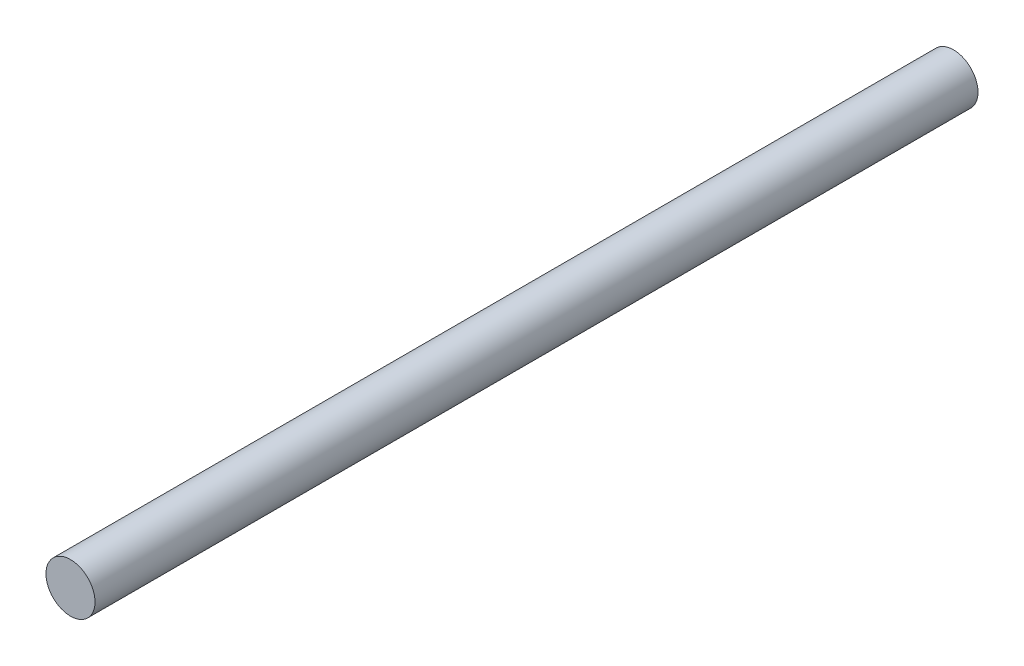
ISO-10303-21;
HEADER;
FILE_DESCRIPTION(('STEP AP214'),'2;1');
FILE_NAME('part.step','',(''),(''),'','','');
FILE_SCHEMA(('AUTOMOTIVE_DESIGN { 1 0 10303 214 1 1 1 1 }'));
ENDSEC;
DATA;
#1=APPLICATION_CONTEXT('core data for automotive mechanical design processes');
#2=APPLICATION_PROTOCOL_DEFINITION('international standard','automotive_design',2000,#1);
#3=PRODUCT_CONTEXT('',#1,'mechanical');
#4=PRODUCT('Part','Part','',(#3));
#5=PRODUCT_RELATED_PRODUCT_CATEGORY('part','',(#4));
#6=PRODUCT_DEFINITION_FORMATION('','',#4);
#7=PRODUCT_DEFINITION_CONTEXT('part definition',#1,'design');
#8=PRODUCT_DEFINITION('design','',#6,#7);
#9=PRODUCT_DEFINITION_SHAPE('','',#8);
#10=(LENGTH_UNIT() NAMED_UNIT(*) SI_UNIT(.MILLI.,.METRE.));
#11=(NAMED_UNIT(*) PLANE_ANGLE_UNIT() SI_UNIT($,.RADIAN.));
#12=(NAMED_UNIT(*) SI_UNIT($,.STERADIAN.) SOLID_ANGLE_UNIT());
#13=UNCERTAINTY_MEASURE_WITH_UNIT(LENGTH_MEASURE(1.E-05),#10,'distance_accuracy_value','');
#14=(GEOMETRIC_REPRESENTATION_CONTEXT(3) GLOBAL_UNCERTAINTY_ASSIGNED_CONTEXT((#13)) GLOBAL_UNIT_ASSIGNED_CONTEXT((#10,
#11,#12)) REPRESENTATION_CONTEXT('',''));
#15=CARTESIAN_POINT('',(0.,0.,0.));
#16=DIRECTION('',(0.,0.,1.));
#17=DIRECTION('',(1.,0.,0.));
#18=AXIS2_PLACEMENT_3D('',#15,#16,#17);
#19=CARTESIAN_POINT('',(0.,0.,180.));
#20=DIRECTION('',(0.,0.,-1.));
#21=DIRECTION('',(-1.,0.,0.));
#22=AXIS2_PLACEMENT_3D('',#19,#20,#21);
#23=CYLINDRICAL_SURFACE('',#22,5.);
#24=CARTESIAN_POINT('',(0.,0.,180.));
#25=DIRECTION('',(0.,0.,1.));
#26=DIRECTION('',(1.,0.,0.));
#27=AXIS2_PLACEMENT_3D('',#24,#25,#26);
#28=CIRCLE('',#27,5.);
#29=CARTESIAN_POINT('',(5.,0.,180.));
#30=VERTEX_POINT('',#29);
#31=EDGE_CURVE('E10',#30,#30,#28,.T.);
#32=ORIENTED_EDGE('',*,*,#31,.F.);
#33=EDGE_LOOP('',(#32));
#34=FACE_BOUND('',#33,.T.);
#35=CARTESIAN_POINT('',(0.,0.,0.));
#36=DIRECTION('',(0.,0.,1.));
#37=DIRECTION('',(1.,0.,0.));
#38=AXIS2_PLACEMENT_3D('',#35,#36,#37);
#39=CIRCLE('',#38,5.);
#40=CARTESIAN_POINT('',(5.,0.,0.));
#41=VERTEX_POINT('',#40);
#42=EDGE_CURVE('E34',#41,#41,#39,.T.);
#43=ORIENTED_EDGE('',*,*,#42,.T.);
#44=EDGE_LOOP('',(#43));
#45=FACE_BOUND('',#44,.T.);
#46=ADVANCED_FACE('F31',(#34,#45),#23,.T.);
#47=CARTESIAN_POINT('',(0.,0.,180.));
#48=DIRECTION('',(0.,0.,1.));
#49=DIRECTION('',(1.,0.,0.));
#50=AXIS2_PLACEMENT_3D('',#47,#48,#49);
#51=PLANE('',#50);
#52=ORIENTED_EDGE('',*,*,#31,.T.);
#53=EDGE_LOOP('',(#52));
#54=FACE_BOUND('',#53,.T.);
#55=ADVANCED_FACE('F46',(#54),#51,.T.);
#56=CARTESIAN_POINT('',(0.,0.,0.));
#57=DIRECTION('',(0.,0.,1.));
#58=DIRECTION('',(1.,0.,0.));
#59=AXIS2_PLACEMENT_3D('',#56,#57,#58);
#60=PLANE('',#59);
#61=ORIENTED_EDGE('',*,*,#42,.F.);
#62=EDGE_LOOP('',(#61));
#63=FACE_BOUND('',#62,.T.);
#64=ADVANCED_FACE('F44',(#63),#60,.F.);
#65=CLOSED_SHELL('',(#46,#55,#64));
#66=MANIFOLD_SOLID_BREP('B2',#65);
#67=ADVANCED_BREP_SHAPE_REPRESENTATION('',(#18,#66),#14);
#68=SHAPE_DEFINITION_REPRESENTATION(#9,#67);
ENDSEC;
END-ISO-10303-21;
